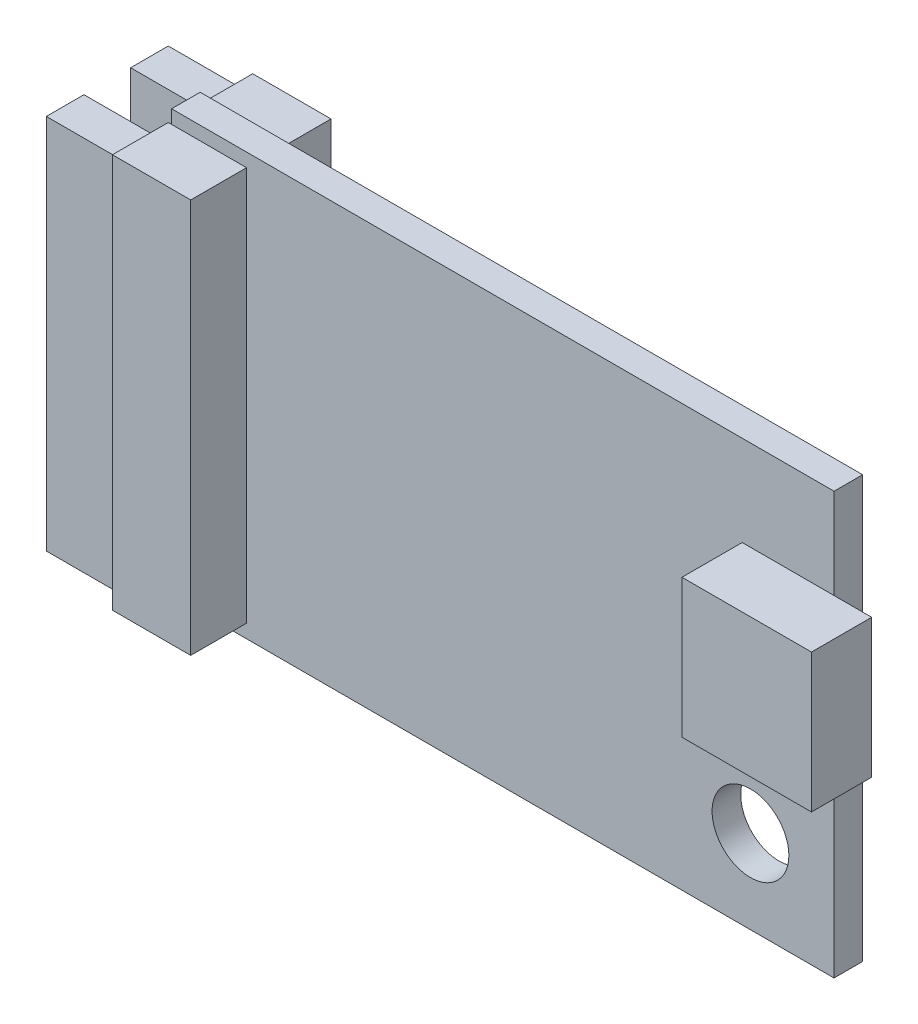
ISO-10303-21;
HEADER;
FILE_DESCRIPTION(('STEP AP214'),'2;1');
FILE_NAME('part.step','',(''),(''),'','','');
FILE_SCHEMA(('AUTOMOTIVE_DESIGN { 1 0 10303 214 1 1 1 1 }'));
ENDSEC;
DATA;
#1=APPLICATION_CONTEXT('core data for automotive mechanical design processes');
#2=APPLICATION_PROTOCOL_DEFINITION('international standard','automotive_design',2000,#1);
#3=PRODUCT_CONTEXT('',#1,'mechanical');
#4=PRODUCT('Part','Part','',(#3));
#5=PRODUCT_RELATED_PRODUCT_CATEGORY('part','',(#4));
#6=PRODUCT_DEFINITION_FORMATION('','',#4);
#7=PRODUCT_DEFINITION_CONTEXT('part definition',#1,'design');
#8=PRODUCT_DEFINITION('design','',#6,#7);
#9=PRODUCT_DEFINITION_SHAPE('','',#8);
#10=(LENGTH_UNIT() NAMED_UNIT(*) SI_UNIT(.MILLI.,.METRE.));
#11=(NAMED_UNIT(*) PLANE_ANGLE_UNIT() SI_UNIT($,.RADIAN.));
#12=(NAMED_UNIT(*) SI_UNIT($,.STERADIAN.) SOLID_ANGLE_UNIT());
#13=UNCERTAINTY_MEASURE_WITH_UNIT(LENGTH_MEASURE(1.E-05),#10,'distance_accuracy_value','');
#14=(GEOMETRIC_REPRESENTATION_CONTEXT(3) GLOBAL_UNCERTAINTY_ASSIGNED_CONTEXT((#13)) GLOBAL_UNIT_ASSIGNED_CONTEXT((#10,
#11,#12)) REPRESENTATION_CONTEXT('',''));
#15=CARTESIAN_POINT('',(0.,0.,0.));
#16=DIRECTION('',(0.,0.,1.));
#17=DIRECTION('',(1.,0.,0.));
#18=AXIS2_PLACEMENT_3D('',#15,#16,#17);
#19=CARTESIAN_POINT('',(0.,0.,0.475));
#20=DIRECTION('',(0.,0.,1.));
#21=DIRECTION('',(1.,0.,0.));
#22=AXIS2_PLACEMENT_3D('',#19,#20,#21);
#23=PLANE('',#22);
#24=CARTESIAN_POINT('',(8.225,-4.225,0.475));
#25=DIRECTION('',(0.,0.,1.));
#26=DIRECTION('',(1.,0.,0.));
#27=AXIS2_PLACEMENT_3D('',#24,#25,#26);
#28=CIRCLE('',#27,1.275);
#29=CARTESIAN_POINT('',(9.50000000000001,-4.225,0.475));
#30=VERTEX_POINT('',#29);
#31=EDGE_CURVE('E371',#30,#30,#28,.T.);
#32=ORIENTED_EDGE('',*,*,#31,.F.);
#33=EDGE_LOOP('',(#32));
#34=FACE_BOUND('',#33,.T.);
#35=DIRECTION('',(0.,1.,0.));
#36=VECTOR('',#35,1.);
#37=CARTESIAN_POINT('',(11.,7.,0.475));
#38=LINE('',#37,#36);
#39=CARTESIAN_POINT('',(11.,-7.,0.475));
#40=VERTEX_POINT('',#39);
#41=CARTESIAN_POINT('',(11.,-0.600000000000002,0.475));
#42=VERTEX_POINT('',#41);
#43=EDGE_CURVE('E377',#40,#42,#38,.T.);
#44=ORIENTED_EDGE('',*,*,#43,.T.);
#45=DIRECTION('',(1.,0.,0.));
#46=VECTOR('',#45,1.);
#47=CARTESIAN_POINT('',(12.25,-0.600000000000002,0.475));
#48=LINE('',#47,#46);
#49=CARTESIAN_POINT('',(7.95000000000001,-0.600000000000002,0.475));
#50=VERTEX_POINT('',#49);
#51=EDGE_CURVE('E51',#50,#42,#48,.T.);
#52=ORIENTED_EDGE('',*,*,#51,.F.);
#53=DIRECTION('',(0.,-1.,0.));
#54=VECTOR('',#53,1.);
#55=CARTESIAN_POINT('',(7.95,4.,0.475));
#56=LINE('',#55,#54);
#57=CARTESIAN_POINT('',(7.95,4.,0.475));
#58=VERTEX_POINT('',#57);
#59=EDGE_CURVE('E56',#58,#50,#56,.T.);
#60=ORIENTED_EDGE('',*,*,#59,.F.);
#61=DIRECTION('',(-1.,0.,0.));
#62=VECTOR('',#61,1.);
#63=CARTESIAN_POINT('',(12.25,4.,0.475));
#64=LINE('',#63,#62);
#65=CARTESIAN_POINT('',(11.,4.,0.475));
#66=VERTEX_POINT('',#65);
#67=EDGE_CURVE('E460',#66,#58,#64,.T.);
#68=ORIENTED_EDGE('',*,*,#67,.F.);
#69=CARTESIAN_POINT('',(11.,7.,0.475));
#70=VERTEX_POINT('',#69);
#71=EDGE_CURVE('E381',#66,#70,#38,.T.);
#72=ORIENTED_EDGE('',*,*,#71,.T.);
#73=DIRECTION('',(-1.,0.,0.));
#74=VECTOR('',#73,1.);
#75=CARTESIAN_POINT('',(-11.,7.,0.475));
#76=LINE('',#75,#74);
#77=CARTESIAN_POINT('',(-11.,7.,0.475));
#78=VERTEX_POINT('',#77);
#79=EDGE_CURVE('E379',#70,#78,#76,.T.);
#80=ORIENTED_EDGE('',*,*,#79,.T.);
#81=DIRECTION('',(0.,-1.,0.));
#82=VECTOR('',#81,1.);
#83=CARTESIAN_POINT('',(-11.,7.,0.475));
#84=LINE('',#83,#82);
#85=CARTESIAN_POINT('',(-11.,6.55,0.475));
#86=VERTEX_POINT('',#85);
#87=EDGE_CURVE('E384',#78,#86,#84,.T.);
#88=ORIENTED_EDGE('',*,*,#87,.T.);
#89=DIRECTION('',(-1.,0.,0.));
#90=VECTOR('',#89,1.);
#91=CARTESIAN_POINT('',(-11.11,6.55,0.475));
#92=LINE('',#91,#90);
#93=CARTESIAN_POINT('',(-8.50999999999999,6.55,0.475));
#94=VERTEX_POINT('',#93);
#95=EDGE_CURVE('E352',#94,#86,#92,.T.);
#96=ORIENTED_EDGE('',*,*,#95,.F.);
#97=DIRECTION('',(0.,1.,0.));
#98=VECTOR('',#97,1.);
#99=CARTESIAN_POINT('',(-8.50999999999999,6.55,0.475));
#100=LINE('',#99,#98);
#101=CARTESIAN_POINT('',(-8.50999999999999,-6.55,0.475));
#102=VERTEX_POINT('',#101);
#103=EDGE_CURVE('E337',#102,#94,#100,.T.);
#104=ORIENTED_EDGE('',*,*,#103,.F.);
#105=DIRECTION('',(1.,0.,0.));
#106=VECTOR('',#105,1.);
#107=CARTESIAN_POINT('',(-11.11,-6.55,0.475));
#108=LINE('',#107,#106);
#109=CARTESIAN_POINT('',(-11.,-6.55,0.475));
#110=VERTEX_POINT('',#109);
#111=EDGE_CURVE('E42',#110,#102,#108,.T.);
#112=ORIENTED_EDGE('',*,*,#111,.F.);
#113=CARTESIAN_POINT('',(-11.,-7.,0.475));
#114=VERTEX_POINT('',#113);
#115=EDGE_CURVE('E383',#110,#114,#84,.T.);
#116=ORIENTED_EDGE('',*,*,#115,.T.);
#117=DIRECTION('',(1.,0.,0.));
#118=VECTOR('',#117,1.);
#119=CARTESIAN_POINT('',(-11.,-7.,0.475));
#120=LINE('',#119,#118);
#121=EDGE_CURVE('E386',#114,#40,#120,.T.);
#122=ORIENTED_EDGE('',*,*,#121,.T.);
#123=EDGE_LOOP('',(#44,#52,#60,#68,#72,#80,#88,#96,#104,#112,#116,#122));
#124=FACE_BOUND('',#123,.T.);
#125=ADVANCED_FACE('F33',(#34,#124),#23,.T.);
#126=CARTESIAN_POINT('',(-11.11,6.55,-2.33));
#127=DIRECTION('',(-1.,0.,0.));
#128=DIRECTION('',(0.,0.,1.));
#129=AXIS2_PLACEMENT_3D('',#126,#127,#128);
#130=PLANE('',#129);
#131=DIRECTION('',(0.,-1.,0.));
#132=VECTOR('',#131,1.);
#133=CARTESIAN_POINT('',(-11.11,6.55,-0.475));
#134=LINE('',#133,#132);
#135=CARTESIAN_POINT('',(-11.11,6.55,-0.475));
#136=VERTEX_POINT('',#135);
#137=CARTESIAN_POINT('',(-11.11,-6.55,-0.475));
#138=VERTEX_POINT('',#137);
#139=EDGE_CURVE('E322',#136,#138,#134,.T.);
#140=ORIENTED_EDGE('',*,*,#139,.F.);
#141=DIRECTION('',(0.,0.,1.));
#142=VECTOR('',#141,1.);
#143=CARTESIAN_POINT('',(-11.11,6.55,-2.33));
#144=LINE('',#143,#142);
#145=CARTESIAN_POINT('',(-11.11,6.55,-2.33));
#146=VERTEX_POINT('',#145);
#147=EDGE_CURVE('E329',#146,#136,#144,.T.);
#148=ORIENTED_EDGE('',*,*,#147,.F.);
#149=DIRECTION('',(0.,-1.,0.));
#150=VECTOR('',#149,1.);
#151=CARTESIAN_POINT('',(-11.11,6.55,-2.33));
#152=LINE('',#151,#150);
#153=CARTESIAN_POINT('',(-11.11,-6.55,-2.33));
#154=VERTEX_POINT('',#153);
#155=EDGE_CURVE('E312',#146,#154,#152,.T.);
#156=ORIENTED_EDGE('',*,*,#155,.T.);
#157=DIRECTION('',(0.,0.,1.));
#158=VECTOR('',#157,1.);
#159=CARTESIAN_POINT('',(-11.11,-6.55,-2.33));
#160=LINE('',#159,#158);
#161=EDGE_CURVE('E332',#154,#138,#160,.T.);
#162=ORIENTED_EDGE('',*,*,#161,.T.);
#163=EDGE_LOOP('',(#140,#148,#156,#162));
#164=FACE_BOUND('',#163,.T.);
#165=DIRECTION('',(0.,0.,1.));
#166=VECTOR('',#165,1.);
#167=CARTESIAN_POINT('',(-11.11,-6.25,-0.774999999999999));
#168=LINE('',#167,#166);
#169=CARTESIAN_POINT('',(-11.11,-6.25,-2.025));
#170=VERTEX_POINT('',#169);
#171=CARTESIAN_POINT('',(-11.11,-6.25,-0.774999999999999));
#172=VERTEX_POINT('',#171);
#173=EDGE_CURVE('E289',#170,#172,#168,.T.);
#174=ORIENTED_EDGE('',*,*,#173,.F.);
#175=DIRECTION('',(0.,-1.,0.));
#176=VECTOR('',#175,1.);
#177=CARTESIAN_POINT('',(-11.11,6.25,-2.025));
#178=LINE('',#177,#176);
#179=CARTESIAN_POINT('',(-11.11,6.25,-2.025));
#180=VERTEX_POINT('',#179);
#181=EDGE_CURVE('E275',#180,#170,#178,.T.);
#182=ORIENTED_EDGE('',*,*,#181,.F.);
#183=DIRECTION('',(0.,0.,-1.));
#184=VECTOR('',#183,1.);
#185=CARTESIAN_POINT('',(-11.11,6.25,-0.775000000000001));
#186=LINE('',#185,#184);
#187=CARTESIAN_POINT('',(-11.11,6.25,-0.775000000000001));
#188=VERTEX_POINT('',#187);
#189=EDGE_CURVE('E280',#188,#180,#186,.T.);
#190=ORIENTED_EDGE('',*,*,#189,.F.);
#191=DIRECTION('',(0.,1.,0.));
#192=VECTOR('',#191,1.);
#193=CARTESIAN_POINT('',(-11.11,6.25,-0.775000000000001));
#194=LINE('',#193,#192);
#195=EDGE_CURVE('E291',#172,#188,#194,.T.);
#196=ORIENTED_EDGE('',*,*,#195,.F.);
#197=EDGE_LOOP('',(#174,#182,#190,#196));
#198=FACE_BOUND('',#197,.T.);
#199=ADVANCED_FACE('F483',(#164,#198),#130,.T.);
#200=CARTESIAN_POINT('',(0.,0.,-0.475));
#201=DIRECTION('',(0.,0.,1.));
#202=DIRECTION('',(1.,0.,0.));
#203=AXIS2_PLACEMENT_3D('',#200,#201,#202);
#204=PLANE('',#203);
#205=DIRECTION('',(0.,1.,0.));
#206=VECTOR('',#205,1.);
#207=CARTESIAN_POINT('',(-8.50999999999999,6.55,-0.475));
#208=LINE('',#207,#206);
#209=CARTESIAN_POINT('',(-8.50999999999999,-6.55,-0.475));
#210=VERTEX_POINT('',#209);
#211=CARTESIAN_POINT('',(-8.50999999999999,6.55,-0.475));
#212=VERTEX_POINT('',#211);
#213=EDGE_CURVE('E304',#210,#212,#208,.T.);
#214=ORIENTED_EDGE('',*,*,#213,.T.);
#215=DIRECTION('',(-1.,0.,0.));
#216=VECTOR('',#215,1.);
#217=CARTESIAN_POINT('',(-11.11,6.55,-0.475));
#218=LINE('',#217,#216);
#219=CARTESIAN_POINT('',(-11.,6.55,-0.475));
#220=VERTEX_POINT('',#219);
#221=EDGE_CURVE('E309',#212,#220,#218,.T.);
#222=ORIENTED_EDGE('',*,*,#221,.T.);
#223=DIRECTION('',(0.,-1.,0.));
#224=VECTOR('',#223,1.);
#225=CARTESIAN_POINT('',(-11.,7.,-0.475));
#226=LINE('',#225,#224);
#227=CARTESIAN_POINT('',(-11.,7.,-0.475));
#228=VERTEX_POINT('',#227);
#229=EDGE_CURVE('E395',#228,#220,#226,.T.);
#230=ORIENTED_EDGE('',*,*,#229,.F.);
#231=DIRECTION('',(-1.,0.,0.));
#232=VECTOR('',#231,1.);
#233=CARTESIAN_POINT('',(-11.,7.,-0.475));
#234=LINE('',#233,#232);
#235=CARTESIAN_POINT('',(11.,7.,-0.475));
#236=VERTEX_POINT('',#235);
#237=EDGE_CURVE('E392',#236,#228,#234,.T.);
#238=ORIENTED_EDGE('',*,*,#237,.F.);
#239=DIRECTION('',(0.,1.,0.));
#240=VECTOR('',#239,1.);
#241=CARTESIAN_POINT('',(11.,7.,-0.475));
#242=LINE('',#241,#240);
#243=CARTESIAN_POINT('',(11.,-7.,-0.475));
#244=VERTEX_POINT('',#243);
#245=EDGE_CURVE('E374',#244,#236,#242,.T.);
#246=ORIENTED_EDGE('',*,*,#245,.F.);
#247=DIRECTION('',(1.,0.,0.));
#248=VECTOR('',#247,1.);
#249=CARTESIAN_POINT('',(-11.,-7.,-0.475));
#250=LINE('',#249,#248);
#251=CARTESIAN_POINT('',(-11.,-7.,-0.475));
#252=VERTEX_POINT('',#251);
#253=EDGE_CURVE('E398',#252,#244,#250,.T.);
#254=ORIENTED_EDGE('',*,*,#253,.F.);
#255=CARTESIAN_POINT('',(-11.,-6.55,-0.475));
#256=VERTEX_POINT('',#255);
#257=EDGE_CURVE('E394',#256,#252,#226,.T.);
#258=ORIENTED_EDGE('',*,*,#257,.F.);
#259=DIRECTION('',(1.,0.,0.));
#260=VECTOR('',#259,1.);
#261=CARTESIAN_POINT('',(-11.11,-6.55,-0.475));
#262=LINE('',#261,#260);
#263=EDGE_CURVE('E11',#256,#210,#262,.T.);
#264=ORIENTED_EDGE('',*,*,#263,.T.);
#265=EDGE_LOOP('',(#214,#222,#230,#238,#246,#254,#258,#264));
#266=FACE_BOUND('',#265,.T.);
#267=CARTESIAN_POINT('',(8.225,-4.225,-0.475));
#268=DIRECTION('',(0.,0.,1.));
#269=DIRECTION('',(1.,0.,0.));
#270=AXIS2_PLACEMENT_3D('',#267,#268,#269);
#271=CIRCLE('',#270,1.275);
#272=CARTESIAN_POINT('',(9.50000000000001,-4.225,-0.475));
#273=VERTEX_POINT('',#272);
#274=EDGE_CURVE('E370',#273,#273,#271,.T.);
#275=ORIENTED_EDGE('',*,*,#274,.T.);
#276=EDGE_LOOP('',(#275));
#277=FACE_BOUND('',#276,.T.);
#278=ADVANCED_FACE('F489',(#266,#277),#204,.F.);
#279=CARTESIAN_POINT('',(11.,7.,0.475));
#280=DIRECTION('',(-1.,0.,0.));
#281=DIRECTION('',(0.,0.,1.));
#282=AXIS2_PLACEMENT_3D('',#279,#280,#281);
#283=PLANE('',#282);
#284=ORIENTED_EDGE('',*,*,#245,.T.);
#285=DIRECTION('',(0.,0.,-1.));
#286=VECTOR('',#285,1.);
#287=CARTESIAN_POINT('',(11.,7.,0.475));
#288=LINE('',#287,#286);
#289=EDGE_CURVE('E37',#70,#236,#288,.T.);
#290=ORIENTED_EDGE('',*,*,#289,.F.);
#291=ORIENTED_EDGE('',*,*,#71,.F.);
#292=EDGE_CURVE('E380',#42,#66,#38,.T.);
#293=ORIENTED_EDGE('',*,*,#292,.F.);
#294=ORIENTED_EDGE('',*,*,#43,.F.);
#295=DIRECTION('',(0.,0.,-1.));
#296=VECTOR('',#295,1.);
#297=CARTESIAN_POINT('',(11.,-7.,0.475));
#298=LINE('',#297,#296);
#299=EDGE_CURVE('E389',#40,#244,#298,.T.);
#300=ORIENTED_EDGE('',*,*,#299,.T.);
#301=EDGE_LOOP('',(#284,#290,#291,#293,#294,#300));
#302=FACE_BOUND('',#301,.T.);
#303=ADVANCED_FACE('F35',(#302),#283,.F.);
#304=CARTESIAN_POINT('',(-11.,7.,0.475));
#305=DIRECTION('',(0.,-1.,0.));
#306=DIRECTION('',(0.,0.,-1.));
#307=AXIS2_PLACEMENT_3D('',#304,#305,#306);
#308=PLANE('',#307);
#309=ORIENTED_EDGE('',*,*,#237,.T.);
#310=DIRECTION('',(0.,0.,-1.));
#311=VECTOR('',#310,1.);
#312=CARTESIAN_POINT('',(-11.,7.,0.475));
#313=LINE('',#312,#311);
#314=EDGE_CURVE('E405',#78,#228,#313,.T.);
#315=ORIENTED_EDGE('',*,*,#314,.F.);
#316=ORIENTED_EDGE('',*,*,#79,.F.);
#317=ORIENTED_EDGE('',*,*,#289,.T.);
#318=EDGE_LOOP('',(#309,#315,#316,#317));
#319=FACE_BOUND('',#318,.T.);
#320=ADVANCED_FACE('F503',(#319),#308,.F.);
#321=CARTESIAN_POINT('',(-11.,7.,0.475));
#322=DIRECTION('',(1.,0.,0.));
#323=DIRECTION('',(0.,0.,-1.));
#324=AXIS2_PLACEMENT_3D('',#321,#322,#323);
#325=PLANE('',#324);
#326=ORIENTED_EDGE('',*,*,#229,.T.);
#327=EDGE_CURVE('E399',#220,#256,#226,.T.);
#328=ORIENTED_EDGE('',*,*,#327,.T.);
#329=ORIENTED_EDGE('',*,*,#257,.T.);
#330=DIRECTION('',(0.,0.,-1.));
#331=VECTOR('',#330,1.);
#332=CARTESIAN_POINT('',(-11.,-7.,0.475));
#333=LINE('',#332,#331);
#334=EDGE_CURVE('E403',#114,#252,#333,.T.);
#335=ORIENTED_EDGE('',*,*,#334,.F.);
#336=ORIENTED_EDGE('',*,*,#115,.F.);
#337=EDGE_CURVE('E387',#86,#110,#84,.T.);
#338=ORIENTED_EDGE('',*,*,#337,.F.);
#339=ORIENTED_EDGE('',*,*,#87,.F.);
#340=ORIENTED_EDGE('',*,*,#314,.T.);
#341=EDGE_LOOP('',(#326,#328,#329,#335,#336,#338,#339,#340));
#342=FACE_BOUND('',#341,.T.);
#343=ADVANCED_FACE('F441',(#342),#325,.F.);
#344=CARTESIAN_POINT('',(-11.,-7.,0.475));
#345=DIRECTION('',(0.,1.,0.));
#346=DIRECTION('',(0.,0.,1.));
#347=AXIS2_PLACEMENT_3D('',#344,#345,#346);
#348=PLANE('',#347);
#349=ORIENTED_EDGE('',*,*,#253,.T.);
#350=ORIENTED_EDGE('',*,*,#299,.F.);
#351=ORIENTED_EDGE('',*,*,#121,.F.);
#352=ORIENTED_EDGE('',*,*,#334,.T.);
#353=EDGE_LOOP('',(#349,#350,#351,#352));
#354=FACE_BOUND('',#353,.T.);
#355=ADVANCED_FACE('F446',(#354),#348,.F.);
#356=CARTESIAN_POINT('',(8.225,-4.225,0.475));
#357=DIRECTION('',(0.,0.,-1.));
#358=DIRECTION('',(-1.,0.,0.));
#359=AXIS2_PLACEMENT_3D('',#356,#357,#358);
#360=CYLINDRICAL_SURFACE('',#359,1.275);
#361=ORIENTED_EDGE('',*,*,#31,.T.);
#362=EDGE_LOOP('',(#361));
#363=FACE_BOUND('',#362,.T.);
#364=ORIENTED_EDGE('',*,*,#274,.F.);
#365=EDGE_LOOP('',(#364));
#366=FACE_BOUND('',#365,.T.);
#367=ADVANCED_FACE('F495',(#363,#366),#360,.F.);
#368=CARTESIAN_POINT('',(0.,0.,0.475));
#369=DIRECTION('',(0.,0.,1.));
#370=DIRECTION('',(1.,0.,0.));
#371=AXIS2_PLACEMENT_3D('',#368,#369,#370);
#372=PLANE('',#371);
#373=CARTESIAN_POINT('',(-11.11,6.55,0.475));
#374=VERTEX_POINT('',#373);
#375=EDGE_CURVE('E351',#86,#374,#92,.T.);
#376=ORIENTED_EDGE('',*,*,#375,.F.);
#377=ORIENTED_EDGE('',*,*,#337,.T.);
#378=CARTESIAN_POINT('',(-11.11,-6.55,0.475));
#379=VERTEX_POINT('',#378);
#380=EDGE_CURVE('E342',#379,#110,#108,.T.);
#381=ORIENTED_EDGE('',*,*,#380,.F.);
#382=DIRECTION('',(0.,-1.,0.));
#383=VECTOR('',#382,1.);
#384=CARTESIAN_POINT('',(-11.11,6.55,0.475));
#385=LINE('',#384,#383);
#386=EDGE_CURVE('E355',#374,#379,#385,.T.);
#387=ORIENTED_EDGE('',*,*,#386,.F.);
#388=EDGE_LOOP('',(#376,#377,#381,#387));
#389=FACE_BOUND('',#388,.T.);
#390=ADVANCED_FACE('F436',(#389),#372,.F.);
#391=CARTESIAN_POINT('',(-8.50999999999999,6.55,2.33));
#392=DIRECTION('',(-1.,0.,0.));
#393=DIRECTION('',(0.,0.,1.));
#394=AXIS2_PLACEMENT_3D('',#391,#392,#393);
#395=PLANE('',#394);
#396=ORIENTED_EDGE('',*,*,#103,.T.);
#397=DIRECTION('',(0.,0.,-1.));
#398=VECTOR('',#397,1.);
#399=CARTESIAN_POINT('',(-8.50999999999999,6.55,2.33));
#400=LINE('',#399,#398);
#401=CARTESIAN_POINT('',(-8.50999999999999,6.55,2.33));
#402=VERTEX_POINT('',#401);
#403=EDGE_CURVE('E367',#402,#94,#400,.T.);
#404=ORIENTED_EDGE('',*,*,#403,.F.);
#405=DIRECTION('',(0.,1.,0.));
#406=VECTOR('',#405,1.);
#407=CARTESIAN_POINT('',(-8.50999999999999,6.55,2.33));
#408=LINE('',#407,#406);
#409=CARTESIAN_POINT('',(-8.50999999999999,-6.55,2.33));
#410=VERTEX_POINT('',#409);
#411=EDGE_CURVE('E338',#410,#402,#408,.T.);
#412=ORIENTED_EDGE('',*,*,#411,.F.);
#413=DIRECTION('',(0.,0.,-1.));
#414=VECTOR('',#413,1.);
#415=CARTESIAN_POINT('',(-8.50999999999999,-6.55,2.33));
#416=LINE('',#415,#414);
#417=EDGE_CURVE('E348',#410,#102,#416,.T.);
#418=ORIENTED_EDGE('',*,*,#417,.T.);
#419=EDGE_LOOP('',(#396,#404,#412,#418));
#420=FACE_BOUND('',#419,.T.);
#421=ADVANCED_FACE('F424',(#420),#395,.F.);
#422=CARTESIAN_POINT('',(-11.11,6.55,2.33));
#423=DIRECTION('',(0.,-1.,0.));
#424=DIRECTION('',(0.,0.,-1.));
#425=AXIS2_PLACEMENT_3D('',#422,#423,#424);
#426=PLANE('',#425);
#427=ORIENTED_EDGE('',*,*,#95,.T.);
#428=ORIENTED_EDGE('',*,*,#375,.T.);
#429=DIRECTION('',(0.,0.,-1.));
#430=VECTOR('',#429,1.);
#431=CARTESIAN_POINT('',(-11.11,6.55,2.33));
#432=LINE('',#431,#430);
#433=CARTESIAN_POINT('',(-11.11,6.55,2.33));
#434=VERTEX_POINT('',#433);
#435=EDGE_CURVE('E364',#434,#374,#432,.T.);
#436=ORIENTED_EDGE('',*,*,#435,.F.);
#437=DIRECTION('',(-1.,0.,0.));
#438=VECTOR('',#437,1.);
#439=CARTESIAN_POINT('',(-11.11,6.55,2.33));
#440=LINE('',#439,#438);
#441=EDGE_CURVE('E341',#402,#434,#440,.T.);
#442=ORIENTED_EDGE('',*,*,#441,.F.);
#443=ORIENTED_EDGE('',*,*,#403,.T.);
#444=EDGE_LOOP('',(#427,#428,#436,#442,#443));
#445=FACE_BOUND('',#444,.T.);
#446=ADVANCED_FACE('F553',(#445),#426,.F.);
#447=CARTESIAN_POINT('',(-11.11,6.55,2.33));
#448=DIRECTION('',(1.,0.,0.));
#449=DIRECTION('',(0.,0.,-1.));
#450=AXIS2_PLACEMENT_3D('',#447,#448,#449);
#451=PLANE('',#450);
#452=DIRECTION('',(0.,0.,1.));
#453=VECTOR('',#452,1.);
#454=CARTESIAN_POINT('',(-11.11,6.25,0.775000000000001));
#455=LINE('',#454,#453);
#456=CARTESIAN_POINT('',(-11.11,6.25,0.775000000000001));
#457=VERTEX_POINT('',#456);
#458=CARTESIAN_POINT('',(-11.11,6.25,2.025));
#459=VERTEX_POINT('',#458);
#460=EDGE_CURVE('E240',#457,#459,#455,.T.);
#461=ORIENTED_EDGE('',*,*,#460,.T.);
#462=DIRECTION('',(0.,-1.,0.));
#463=VECTOR('',#462,1.);
#464=CARTESIAN_POINT('',(-11.11,6.25,2.025));
#465=LINE('',#464,#463);
#466=CARTESIAN_POINT('',(-11.11,-6.25,2.025));
#467=VERTEX_POINT('',#466);
#468=EDGE_CURVE('E237',#459,#467,#465,.T.);
#469=ORIENTED_EDGE('',*,*,#468,.T.);
#470=DIRECTION('',(0.,0.,-1.));
#471=VECTOR('',#470,1.);
#472=CARTESIAN_POINT('',(-11.11,-6.25,0.774999999999999));
#473=LINE('',#472,#471);
#474=CARTESIAN_POINT('',(-11.11,-6.25,0.774999999999999));
#475=VERTEX_POINT('',#474);
#476=EDGE_CURVE('E250',#467,#475,#473,.T.);
#477=ORIENTED_EDGE('',*,*,#476,.T.);
#478=DIRECTION('',(0.,1.,0.));
#479=VECTOR('',#478,1.);
#480=CARTESIAN_POINT('',(-11.11,6.25,0.775000000000001));
#481=LINE('',#480,#479);
#482=EDGE_CURVE('E262',#475,#457,#481,.T.);
#483=ORIENTED_EDGE('',*,*,#482,.T.);
#484=EDGE_LOOP('',(#461,#469,#477,#483));
#485=FACE_BOUND('',#484,.T.);
#486=ORIENTED_EDGE('',*,*,#386,.T.);
#487=DIRECTION('',(0.,0.,-1.));
#488=VECTOR('',#487,1.);
#489=CARTESIAN_POINT('',(-11.11,-6.55,2.33));
#490=LINE('',#489,#488);
#491=CARTESIAN_POINT('',(-11.11,-6.55,2.33));
#492=VERTEX_POINT('',#491);
#493=EDGE_CURVE('E361',#492,#379,#490,.T.);
#494=ORIENTED_EDGE('',*,*,#493,.F.);
#495=DIRECTION('',(0.,-1.,0.));
#496=VECTOR('',#495,1.);
#497=CARTESIAN_POINT('',(-11.11,6.55,2.33));
#498=LINE('',#497,#496);
#499=EDGE_CURVE('E344',#434,#492,#498,.T.);
#500=ORIENTED_EDGE('',*,*,#499,.F.);
#501=ORIENTED_EDGE('',*,*,#435,.T.);
#502=EDGE_LOOP('',(#486,#494,#500,#501));
#503=FACE_BOUND('',#502,.T.);
#504=ADVANCED_FACE('F550',(#485,#503),#451,.F.);
#505=CARTESIAN_POINT('',(-11.11,-6.55,2.33));
#506=DIRECTION('',(0.,1.,0.));
#507=DIRECTION('',(0.,0.,1.));
#508=AXIS2_PLACEMENT_3D('',#505,#506,#507);
#509=PLANE('',#508);
#510=ORIENTED_EDGE('',*,*,#380,.T.);
#511=ORIENTED_EDGE('',*,*,#111,.T.);
#512=ORIENTED_EDGE('',*,*,#417,.F.);
#513=DIRECTION('',(1.,0.,0.));
#514=VECTOR('',#513,1.);
#515=CARTESIAN_POINT('',(-11.11,-6.55,2.33));
#516=LINE('',#515,#514);
#517=EDGE_CURVE('E346',#492,#410,#516,.T.);
#518=ORIENTED_EDGE('',*,*,#517,.F.);
#519=ORIENTED_EDGE('',*,*,#493,.T.);
#520=EDGE_LOOP('',(#510,#511,#512,#518,#519));
#521=FACE_BOUND('',#520,.T.);
#522=ADVANCED_FACE('F418',(#521),#509,.F.);
#523=CARTESIAN_POINT('',(0.,0.,2.33));
#524=DIRECTION('',(0.,0.,1.));
#525=DIRECTION('',(1.,0.,0.));
#526=AXIS2_PLACEMENT_3D('',#523,#524,#525);
#527=PLANE('',#526);
#528=ORIENTED_EDGE('',*,*,#411,.T.);
#529=ORIENTED_EDGE('',*,*,#441,.T.);
#530=ORIENTED_EDGE('',*,*,#499,.T.);
#531=ORIENTED_EDGE('',*,*,#517,.T.);
#532=EDGE_LOOP('',(#528,#529,#530,#531));
#533=FACE_BOUND('',#532,.T.);
#534=ADVANCED_FACE('F427',(#533),#527,.T.);
#535=CARTESIAN_POINT('',(-8.50999999999999,6.55,-2.33));
#536=DIRECTION('',(1.,0.,0.));
#537=DIRECTION('',(0.,0.,-1.));
#538=AXIS2_PLACEMENT_3D('',#535,#536,#537);
#539=PLANE('',#538);
#540=ORIENTED_EDGE('',*,*,#213,.F.);
#541=DIRECTION('',(0.,0.,1.));
#542=VECTOR('',#541,1.);
#543=CARTESIAN_POINT('',(-8.50999999999999,-6.55,-2.33));
#544=LINE('',#543,#542);
#545=CARTESIAN_POINT('',(-8.50999999999999,-6.55,-2.33));
#546=VERTEX_POINT('',#545);
#547=EDGE_CURVE('E334',#546,#210,#544,.T.);
#548=ORIENTED_EDGE('',*,*,#547,.F.);
#549=DIRECTION('',(0.,1.,0.));
#550=VECTOR('',#549,1.);
#551=CARTESIAN_POINT('',(-8.50999999999999,6.55,-2.33));
#552=LINE('',#551,#550);
#553=CARTESIAN_POINT('',(-8.50999999999999,6.55,-2.33));
#554=VERTEX_POINT('',#553);
#555=EDGE_CURVE('E305',#546,#554,#552,.T.);
#556=ORIENTED_EDGE('',*,*,#555,.T.);
#557=DIRECTION('',(0.,0.,1.));
#558=VECTOR('',#557,1.);
#559=CARTESIAN_POINT('',(-8.50999999999999,6.55,-2.33));
#560=LINE('',#559,#558);
#561=EDGE_CURVE('E318',#554,#212,#560,.T.);
#562=ORIENTED_EDGE('',*,*,#561,.T.);
#563=EDGE_LOOP('',(#540,#548,#556,#562));
#564=FACE_BOUND('',#563,.T.);
#565=ADVANCED_FACE('F524',(#564),#539,.T.);
#566=CARTESIAN_POINT('',(-11.11,-6.55,-2.33));
#567=DIRECTION('',(0.,-1.,0.));
#568=DIRECTION('',(0.,0.,-1.));
#569=AXIS2_PLACEMENT_3D('',#566,#567,#568);
#570=PLANE('',#569);
#571=EDGE_CURVE('E44',#138,#256,#262,.T.);
#572=ORIENTED_EDGE('',*,*,#571,.F.);
#573=ORIENTED_EDGE('',*,*,#161,.F.);
#574=DIRECTION('',(1.,0.,0.));
#575=VECTOR('',#574,1.);
#576=CARTESIAN_POINT('',(-11.11,-6.55,-2.33));
#577=LINE('',#576,#575);
#578=EDGE_CURVE('E308',#154,#546,#577,.T.);
#579=ORIENTED_EDGE('',*,*,#578,.T.);
#580=ORIENTED_EDGE('',*,*,#547,.T.);
#581=ORIENTED_EDGE('',*,*,#263,.F.);
#582=EDGE_LOOP('',(#572,#573,#579,#580,#581));
#583=FACE_BOUND('',#582,.T.);
#584=ADVANCED_FACE('F522',(#583),#570,.T.);
#585=CARTESIAN_POINT('',(-11.11,6.55,-2.33));
#586=DIRECTION('',(0.,1.,0.));
#587=DIRECTION('',(0.,0.,1.));
#588=AXIS2_PLACEMENT_3D('',#585,#586,#587);
#589=PLANE('',#588);
#590=ORIENTED_EDGE('',*,*,#221,.F.);
#591=ORIENTED_EDGE('',*,*,#561,.F.);
#592=DIRECTION('',(-1.,0.,0.));
#593=VECTOR('',#592,1.);
#594=CARTESIAN_POINT('',(-11.11,6.55,-2.33));
#595=LINE('',#594,#593);
#596=EDGE_CURVE('E315',#554,#146,#595,.T.);
#597=ORIENTED_EDGE('',*,*,#596,.T.);
#598=ORIENTED_EDGE('',*,*,#147,.T.);
#599=EDGE_CURVE('E325',#220,#136,#218,.T.);
#600=ORIENTED_EDGE('',*,*,#599,.F.);
#601=EDGE_LOOP('',(#590,#591,#597,#598,#600));
#602=FACE_BOUND('',#601,.T.);
#603=ADVANCED_FACE('F515',(#602),#589,.T.);
#604=CARTESIAN_POINT('',(0.,0.,-2.33));
#605=DIRECTION('',(0.,0.,-1.));
#606=DIRECTION('',(1.,0.,0.));
#607=AXIS2_PLACEMENT_3D('',#604,#605,#606);
#608=PLANE('',#607);
#609=ORIENTED_EDGE('',*,*,#555,.F.);
#610=ORIENTED_EDGE('',*,*,#578,.F.);
#611=ORIENTED_EDGE('',*,*,#155,.F.);
#612=ORIENTED_EDGE('',*,*,#596,.F.);
#613=EDGE_LOOP('',(#609,#610,#611,#612));
#614=FACE_BOUND('',#613,.T.);
#615=ADVANCED_FACE('F527',(#614),#608,.T.);
#616=CARTESIAN_POINT('',(0.,0.,-0.475));
#617=DIRECTION('',(0.,0.,-1.));
#618=DIRECTION('',(1.,0.,0.));
#619=AXIS2_PLACEMENT_3D('',#616,#617,#618);
#620=PLANE('',#619);
#621=ORIENTED_EDGE('',*,*,#327,.F.);
#622=ORIENTED_EDGE('',*,*,#599,.T.);
#623=ORIENTED_EDGE('',*,*,#139,.T.);
#624=ORIENTED_EDGE('',*,*,#571,.T.);
#625=EDGE_LOOP('',(#621,#622,#623,#624));
#626=FACE_BOUND('',#625,.T.);
#627=ADVANCED_FACE('F512',(#626),#620,.F.);
#628=CARTESIAN_POINT('',(-13.61,6.25,-2.025));
#629=DIRECTION('',(0.,0.,1.));
#630=DIRECTION('',(0.,-1.,0.));
#631=AXIS2_PLACEMENT_3D('',#628,#629,#630);
#632=PLANE('',#631);
#633=ORIENTED_EDGE('',*,*,#181,.T.);
#634=DIRECTION('',(1.,0.,0.));
#635=VECTOR('',#634,1.);
#636=CARTESIAN_POINT('',(-13.61,-6.25,-2.025));
#637=LINE('',#636,#635);
#638=CARTESIAN_POINT('',(-13.61,-6.25,-2.025));
#639=VERTEX_POINT('',#638);
#640=EDGE_CURVE('E302',#639,#170,#637,.T.);
#641=ORIENTED_EDGE('',*,*,#640,.F.);
#642=DIRECTION('',(0.,-1.,0.));
#643=VECTOR('',#642,1.);
#644=CARTESIAN_POINT('',(-13.61,6.25,-2.025));
#645=LINE('',#644,#643);
#646=CARTESIAN_POINT('',(-13.61,6.25,-2.025));
#647=VERTEX_POINT('',#646);
#648=EDGE_CURVE('E276',#647,#639,#645,.T.);
#649=ORIENTED_EDGE('',*,*,#648,.F.);
#650=DIRECTION('',(1.,0.,0.));
#651=VECTOR('',#650,1.);
#652=CARTESIAN_POINT('',(-13.61,6.25,-2.025));
#653=LINE('',#652,#651);
#654=EDGE_CURVE('E286',#647,#180,#653,.T.);
#655=ORIENTED_EDGE('',*,*,#654,.T.);
#656=EDGE_LOOP('',(#633,#641,#649,#655));
#657=FACE_BOUND('',#656,.T.);
#658=ADVANCED_FACE('F534',(#657),#632,.F.);
#659=CARTESIAN_POINT('',(-13.61,-6.25,-0.774999999999999));
#660=DIRECTION('',(0.,1.,0.));
#661=DIRECTION('',(0.,0.,1.));
#662=AXIS2_PLACEMENT_3D('',#659,#660,#661);
#663=PLANE('',#662);
#664=ORIENTED_EDGE('',*,*,#173,.T.);
#665=DIRECTION('',(1.,0.,0.));
#666=VECTOR('',#665,1.);
#667=CARTESIAN_POINT('',(-13.61,-6.25,-0.774999999999999));
#668=LINE('',#667,#666);
#669=CARTESIAN_POINT('',(-13.61,-6.25,-0.774999999999999));
#670=VERTEX_POINT('',#669);
#671=EDGE_CURVE('E299',#670,#172,#668,.T.);
#672=ORIENTED_EDGE('',*,*,#671,.F.);
#673=DIRECTION('',(0.,0.,1.));
#674=VECTOR('',#673,1.);
#675=CARTESIAN_POINT('',(-13.61,-6.25,-0.774999999999999));
#676=LINE('',#675,#674);
#677=EDGE_CURVE('E279',#639,#670,#676,.T.);
#678=ORIENTED_EDGE('',*,*,#677,.F.);
#679=ORIENTED_EDGE('',*,*,#640,.T.);
#680=EDGE_LOOP('',(#664,#672,#678,#679));
#681=FACE_BOUND('',#680,.T.);
#682=ADVANCED_FACE('F620',(#681),#663,.F.);
#683=CARTESIAN_POINT('',(-13.61,6.25,-0.775000000000001));
#684=DIRECTION('',(0.,0.,-1.));
#685=DIRECTION('',(0.,1.,0.));
#686=AXIS2_PLACEMENT_3D('',#683,#684,#685);
#687=PLANE('',#686);
#688=ORIENTED_EDGE('',*,*,#195,.T.);
#689=DIRECTION('',(1.,0.,0.));
#690=VECTOR('',#689,1.);
#691=CARTESIAN_POINT('',(-13.61,6.25,-0.775000000000001));
#692=LINE('',#691,#690);
#693=CARTESIAN_POINT('',(-13.61,6.25,-0.775000000000001));
#694=VERTEX_POINT('',#693);
#695=EDGE_CURVE('E297',#694,#188,#692,.T.);
#696=ORIENTED_EDGE('',*,*,#695,.F.);
#697=DIRECTION('',(0.,1.,0.));
#698=VECTOR('',#697,1.);
#699=CARTESIAN_POINT('',(-13.61,6.25,-0.775000000000001));
#700=LINE('',#699,#698);
#701=EDGE_CURVE('E282',#670,#694,#700,.T.);
#702=ORIENTED_EDGE('',*,*,#701,.F.);
#703=ORIENTED_EDGE('',*,*,#671,.T.);
#704=EDGE_LOOP('',(#688,#696,#702,#703));
#705=FACE_BOUND('',#704,.T.);
#706=ADVANCED_FACE('F629',(#705),#687,.F.);
#707=CARTESIAN_POINT('',(-13.61,6.25,-0.775000000000001));
#708=DIRECTION('',(0.,-1.,0.));
#709=DIRECTION('',(0.,0.,-1.));
#710=AXIS2_PLACEMENT_3D('',#707,#708,#709);
#711=PLANE('',#710);
#712=ORIENTED_EDGE('',*,*,#189,.T.);
#713=ORIENTED_EDGE('',*,*,#654,.F.);
#714=DIRECTION('',(0.,0.,-1.));
#715=VECTOR('',#714,1.);
#716=CARTESIAN_POINT('',(-13.61,6.25,-0.775000000000001));
#717=LINE('',#716,#715);
#718=EDGE_CURVE('E284',#694,#647,#717,.T.);
#719=ORIENTED_EDGE('',*,*,#718,.F.);
#720=ORIENTED_EDGE('',*,*,#695,.T.);
#721=EDGE_LOOP('',(#712,#713,#719,#720));
#722=FACE_BOUND('',#721,.T.);
#723=ADVANCED_FACE('F638',(#722),#711,.F.);
#724=CARTESIAN_POINT('',(-13.61,0.,0.));
#725=DIRECTION('',(1.,0.,0.));
#726=DIRECTION('',(0.,0.,-1.));
#727=AXIS2_PLACEMENT_3D('',#724,#725,#726);
#728=PLANE('',#727);
#729=ORIENTED_EDGE('',*,*,#648,.T.);
#730=ORIENTED_EDGE('',*,*,#677,.T.);
#731=ORIENTED_EDGE('',*,*,#701,.T.);
#732=ORIENTED_EDGE('',*,*,#718,.T.);
#733=EDGE_LOOP('',(#729,#730,#731,#732));
#734=FACE_BOUND('',#733,.T.);
#735=ADVANCED_FACE('F647',(#734),#728,.F.);
#736=CARTESIAN_POINT('',(-13.61,6.25,2.025));
#737=DIRECTION('',(0.,0.,1.));
#738=DIRECTION('',(0.,-1.,0.));
#739=AXIS2_PLACEMENT_3D('',#736,#737,#738);
#740=PLANE('',#739);
#741=ORIENTED_EDGE('',*,*,#468,.F.);
#742=DIRECTION('',(1.,0.,0.));
#743=VECTOR('',#742,1.);
#744=CARTESIAN_POINT('',(-13.61,6.25,2.025));
#745=LINE('',#744,#743);
#746=CARTESIAN_POINT('',(-13.61,6.25,2.025));
#747=VERTEX_POINT('',#746);
#748=EDGE_CURVE('E273',#747,#459,#745,.T.);
#749=ORIENTED_EDGE('',*,*,#748,.F.);
#750=DIRECTION('',(0.,-1.,0.));
#751=VECTOR('',#750,1.);
#752=CARTESIAN_POINT('',(-13.61,6.25,2.025));
#753=LINE('',#752,#751);
#754=CARTESIAN_POINT('',(-13.61,-6.25,2.025));
#755=VERTEX_POINT('',#754);
#756=EDGE_CURVE('E246',#747,#755,#753,.T.);
#757=ORIENTED_EDGE('',*,*,#756,.T.);
#758=DIRECTION('',(1.,0.,0.));
#759=VECTOR('',#758,1.);
#760=CARTESIAN_POINT('',(-13.61,-6.25,2.025));
#761=LINE('',#760,#759);
#762=EDGE_CURVE('E258',#755,#467,#761,.T.);
#763=ORIENTED_EDGE('',*,*,#762,.T.);
#764=EDGE_LOOP('',(#741,#749,#757,#763));
#765=FACE_BOUND('',#764,.T.);
#766=ADVANCED_FACE('F656',(#765),#740,.T.);
#767=CARTESIAN_POINT('',(-13.61,6.25,0.775000000000001));
#768=DIRECTION('',(0.,1.,0.));
#769=DIRECTION('',(0.,0.,1.));
#770=AXIS2_PLACEMENT_3D('',#767,#768,#769);
#771=PLANE('',#770);
#772=ORIENTED_EDGE('',*,*,#460,.F.);
#773=DIRECTION('',(1.,0.,0.));
#774=VECTOR('',#773,1.);
#775=CARTESIAN_POINT('',(-13.61,6.25,0.775000000000001));
#776=LINE('',#775,#774);
#777=CARTESIAN_POINT('',(-13.61,6.25,0.775000000000001));
#778=VERTEX_POINT('',#777);
#779=EDGE_CURVE('E271',#778,#457,#776,.T.);
#780=ORIENTED_EDGE('',*,*,#779,.F.);
#781=DIRECTION('',(0.,0.,1.));
#782=VECTOR('',#781,1.);
#783=CARTESIAN_POINT('',(-13.61,6.25,0.775000000000001));
#784=LINE('',#783,#782);
#785=EDGE_CURVE('E249',#778,#747,#784,.T.);
#786=ORIENTED_EDGE('',*,*,#785,.T.);
#787=ORIENTED_EDGE('',*,*,#748,.T.);
#788=EDGE_LOOP('',(#772,#780,#786,#787));
#789=FACE_BOUND('',#788,.T.);
#790=ADVANCED_FACE('F666',(#789),#771,.T.);
#791=CARTESIAN_POINT('',(-13.61,6.25,0.775000000000001));
#792=DIRECTION('',(0.,0.,-1.));
#793=DIRECTION('',(0.,1.,0.));
#794=AXIS2_PLACEMENT_3D('',#791,#792,#793);
#795=PLANE('',#794);
#796=ORIENTED_EDGE('',*,*,#482,.F.);
#797=DIRECTION('',(1.,0.,0.));
#798=VECTOR('',#797,1.);
#799=CARTESIAN_POINT('',(-13.61,-6.25,0.774999999999999));
#800=LINE('',#799,#798);
#801=CARTESIAN_POINT('',(-13.61,-6.25,0.774999999999999));
#802=VERTEX_POINT('',#801);
#803=EDGE_CURVE('E268',#802,#475,#800,.T.);
#804=ORIENTED_EDGE('',*,*,#803,.F.);
#805=DIRECTION('',(0.,1.,0.));
#806=VECTOR('',#805,1.);
#807=CARTESIAN_POINT('',(-13.61,6.25,0.775000000000001));
#808=LINE('',#807,#806);
#809=EDGE_CURVE('E253',#802,#778,#808,.T.);
#810=ORIENTED_EDGE('',*,*,#809,.T.);
#811=ORIENTED_EDGE('',*,*,#779,.T.);
#812=EDGE_LOOP('',(#796,#804,#810,#811));
#813=FACE_BOUND('',#812,.T.);
#814=ADVANCED_FACE('F673',(#813),#795,.T.);
#815=CARTESIAN_POINT('',(-13.61,-6.25,0.774999999999999));
#816=DIRECTION('',(0.,-1.,0.));
#817=DIRECTION('',(0.,0.,-1.));
#818=AXIS2_PLACEMENT_3D('',#815,#816,#817);
#819=PLANE('',#818);
#820=ORIENTED_EDGE('',*,*,#476,.F.);
#821=ORIENTED_EDGE('',*,*,#762,.F.);
#822=DIRECTION('',(0.,0.,-1.));
#823=VECTOR('',#822,1.);
#824=CARTESIAN_POINT('',(-13.61,-6.25,0.774999999999999));
#825=LINE('',#824,#823);
#826=EDGE_CURVE('E256',#755,#802,#825,.T.);
#827=ORIENTED_EDGE('',*,*,#826,.T.);
#828=ORIENTED_EDGE('',*,*,#803,.T.);
#829=EDGE_LOOP('',(#820,#821,#827,#828));
#830=FACE_BOUND('',#829,.T.);
#831=ADVANCED_FACE('F681',(#830),#819,.T.);
#832=CARTESIAN_POINT('',(-13.61,0.,0.));
#833=DIRECTION('',(1.,0.,0.));
#834=DIRECTION('',(0.,0.,1.));
#835=AXIS2_PLACEMENT_3D('',#832,#833,#834);
#836=PLANE('',#835);
#837=ORIENTED_EDGE('',*,*,#756,.F.);
#838=ORIENTED_EDGE('',*,*,#785,.F.);
#839=ORIENTED_EDGE('',*,*,#809,.F.);
#840=ORIENTED_EDGE('',*,*,#826,.F.);
#841=EDGE_LOOP('',(#837,#838,#839,#840));
#842=FACE_BOUND('',#841,.T.);
#843=ADVANCED_FACE('F689',(#842),#836,.F.);
#844=CARTESIAN_POINT('',(0.,0.,0.475));
#845=DIRECTION('',(0.,0.,-1.));
#846=DIRECTION('',(-1.,0.,0.));
#847=AXIS2_PLACEMENT_3D('',#844,#845,#846);
#848=PLANE('',#847);
#849=ORIENTED_EDGE('',*,*,#292,.T.);
#850=CARTESIAN_POINT('',(12.25,4.,0.475));
#851=VERTEX_POINT('',#850);
#852=EDGE_CURVE('E234',#851,#66,#64,.T.);
#853=ORIENTED_EDGE('',*,*,#852,.F.);
#854=DIRECTION('',(0.,1.,0.));
#855=VECTOR('',#854,1.);
#856=CARTESIAN_POINT('',(12.25,4.,0.475));
#857=LINE('',#856,#855);
#858=CARTESIAN_POINT('',(12.25,-0.600000000000002,0.475));
#859=VERTEX_POINT('',#858);
#860=EDGE_CURVE('E458',#859,#851,#857,.T.);
#861=ORIENTED_EDGE('',*,*,#860,.F.);
#862=EDGE_CURVE('E454',#42,#859,#48,.T.);
#863=ORIENTED_EDGE('',*,*,#862,.F.);
#864=EDGE_LOOP('',(#849,#853,#861,#863));
#865=FACE_BOUND('',#864,.T.);
#866=ADVANCED_FACE('F455',(#865),#848,.T.);
#867=CARTESIAN_POINT('',(7.95,4.,2.475));
#868=DIRECTION('',(1.,0.,0.));
#869=DIRECTION('',(0.,1.,0.));
#870=AXIS2_PLACEMENT_3D('',#867,#868,#869);
#871=PLANE('',#870);
#872=ORIENTED_EDGE('',*,*,#59,.T.);
#873=DIRECTION('',(0.,0.,-1.));
#874=VECTOR('',#873,1.);
#875=CARTESIAN_POINT('',(7.95000000000001,-0.600000000000002,2.475));
#876=LINE('',#875,#874);
#877=CARTESIAN_POINT('',(7.95000000000001,-0.600000000000002,2.475));
#878=VERTEX_POINT('',#877);
#879=EDGE_CURVE('E219',#878,#50,#876,.T.);
#880=ORIENTED_EDGE('',*,*,#879,.F.);
#881=DIRECTION('',(0.,-1.,0.));
#882=VECTOR('',#881,1.);
#883=CARTESIAN_POINT('',(7.95,4.,2.475));
#884=LINE('',#883,#882);
#885=CARTESIAN_POINT('',(7.95,4.,2.475));
#886=VERTEX_POINT('',#885);
#887=EDGE_CURVE('E225',#886,#878,#884,.T.);
#888=ORIENTED_EDGE('',*,*,#887,.F.);
#889=DIRECTION('',(0.,0.,-1.));
#890=VECTOR('',#889,1.);
#891=CARTESIAN_POINT('',(7.95,4.,2.475));
#892=LINE('',#891,#890);
#893=EDGE_CURVE('E466',#886,#58,#892,.T.);
#894=ORIENTED_EDGE('',*,*,#893,.T.);
#895=EDGE_LOOP('',(#872,#880,#888,#894));
#896=FACE_BOUND('',#895,.T.);
#897=ADVANCED_FACE('F236',(#896),#871,.F.);
#898=CARTESIAN_POINT('',(12.25,-0.600000000000002,2.475));
#899=DIRECTION('',(0.,1.,0.));
#900=DIRECTION('',(-1.,0.,0.));
#901=AXIS2_PLACEMENT_3D('',#898,#899,#900);
#902=PLANE('',#901);
#903=ORIENTED_EDGE('',*,*,#51,.T.);
#904=ORIENTED_EDGE('',*,*,#862,.T.);
#905=DIRECTION('',(0.,0.,-1.));
#906=VECTOR('',#905,1.);
#907=CARTESIAN_POINT('',(12.25,-0.600000000000002,2.475));
#908=LINE('',#907,#906);
#909=CARTESIAN_POINT('',(12.25,-0.600000000000002,2.475));
#910=VERTEX_POINT('',#909);
#911=EDGE_CURVE('E221',#910,#859,#908,.T.);
#912=ORIENTED_EDGE('',*,*,#911,.F.);
#913=DIRECTION('',(1.,0.,0.));
#914=VECTOR('',#913,1.);
#915=CARTESIAN_POINT('',(12.25,-0.600000000000002,2.475));
#916=LINE('',#915,#914);
#917=EDGE_CURVE('E215',#878,#910,#916,.T.);
#918=ORIENTED_EDGE('',*,*,#917,.F.);
#919=ORIENTED_EDGE('',*,*,#879,.T.);
#920=EDGE_LOOP('',(#903,#904,#912,#918,#919));
#921=FACE_BOUND('',#920,.T.);
#922=ADVANCED_FACE('F217',(#921),#902,.F.);
#923=CARTESIAN_POINT('',(12.25,4.,2.475));
#924=DIRECTION('',(-1.,0.,0.));
#925=DIRECTION('',(0.,0.,1.));
#926=AXIS2_PLACEMENT_3D('',#923,#924,#925);
#927=PLANE('',#926);
#928=ORIENTED_EDGE('',*,*,#860,.T.);
#929=DIRECTION('',(0.,0.,-1.));
#930=VECTOR('',#929,1.);
#931=CARTESIAN_POINT('',(12.25,4.,2.475));
#932=LINE('',#931,#930);
#933=CARTESIAN_POINT('',(12.25,4.,2.475));
#934=VERTEX_POINT('',#933);
#935=EDGE_CURVE('E242',#934,#851,#932,.T.);
#936=ORIENTED_EDGE('',*,*,#935,.F.);
#937=DIRECTION('',(0.,1.,0.));
#938=VECTOR('',#937,1.);
#939=CARTESIAN_POINT('',(12.25,4.,2.475));
#940=LINE('',#939,#938);
#941=EDGE_CURVE('E224',#910,#934,#940,.T.);
#942=ORIENTED_EDGE('',*,*,#941,.F.);
#943=ORIENTED_EDGE('',*,*,#911,.T.);
#944=EDGE_LOOP('',(#928,#936,#942,#943));
#945=FACE_BOUND('',#944,.T.);
#946=ADVANCED_FACE('F472',(#945),#927,.F.);
#947=CARTESIAN_POINT('',(12.25,4.,2.475));
#948=DIRECTION('',(0.,-1.,0.));
#949=DIRECTION('',(1.,0.,0.));
#950=AXIS2_PLACEMENT_3D('',#947,#948,#949);
#951=PLANE('',#950);
#952=ORIENTED_EDGE('',*,*,#852,.T.);
#953=ORIENTED_EDGE('',*,*,#67,.T.);
#954=ORIENTED_EDGE('',*,*,#893,.F.);
#955=DIRECTION('',(-1.,0.,0.));
#956=VECTOR('',#955,1.);
#957=CARTESIAN_POINT('',(12.25,4.,2.475));
#958=LINE('',#957,#956);
#959=EDGE_CURVE('E230',#934,#886,#958,.T.);
#960=ORIENTED_EDGE('',*,*,#959,.F.);
#961=ORIENTED_EDGE('',*,*,#935,.T.);
#962=EDGE_LOOP('',(#952,#953,#954,#960,#961));
#963=FACE_BOUND('',#962,.T.);
#964=ADVANCED_FACE('F470',(#963),#951,.F.);
#965=CARTESIAN_POINT('',(0.,0.,2.475));
#966=DIRECTION('',(0.,0.,-1.));
#967=DIRECTION('',(-1.,0.,0.));
#968=AXIS2_PLACEMENT_3D('',#965,#966,#967);
#969=PLANE('',#968);
#970=ORIENTED_EDGE('',*,*,#887,.T.);
#971=ORIENTED_EDGE('',*,*,#917,.T.);
#972=ORIENTED_EDGE('',*,*,#941,.T.);
#973=ORIENTED_EDGE('',*,*,#959,.T.);
#974=EDGE_LOOP('',(#970,#971,#972,#973));
#975=FACE_BOUND('',#974,.T.);
#976=ADVANCED_FACE('F228',(#975),#969,.F.);
#977=CLOSED_SHELL('',(#125,#199,#278,#303,#320,#343,#355,#367,#390,#421,#446,#504,#522,#534,
#565,#584,#603,#615,#627,#658,#682,#706,#723,#735,#766,#790,#814,#831,#843,#866,#897,#922,#946,
#964,#976));
#978=MANIFOLD_SOLID_BREP('B2',#977);
#979=ADVANCED_BREP_SHAPE_REPRESENTATION('',(#18,#978),#14);
#980=SHAPE_DEFINITION_REPRESENTATION(#9,#979);
ENDSEC;
END-ISO-10303-21;
